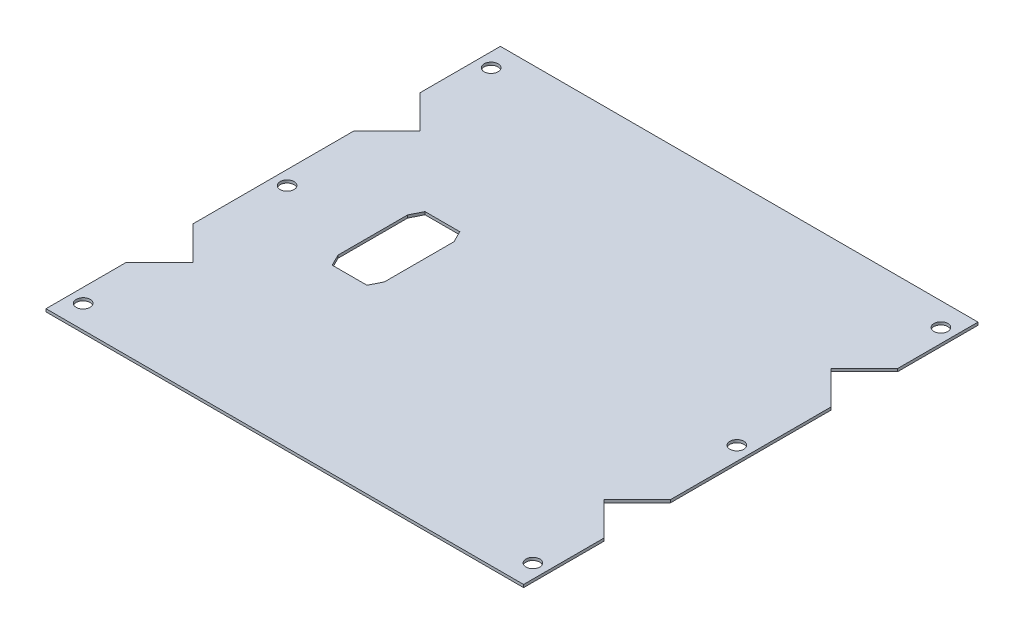
ISO-10303-21;
HEADER;
FILE_DESCRIPTION(('STEP AP214'),'2;1');
FILE_NAME('part.step','',(''),(''),'','','');
FILE_SCHEMA(('AUTOMOTIVE_DESIGN { 1 0 10303 214 1 1 1 1 }'));
ENDSEC;
DATA;
#1=APPLICATION_CONTEXT('core data for automotive mechanical design processes');
#2=APPLICATION_PROTOCOL_DEFINITION('international standard','automotive_design',2000,#1);
#3=PRODUCT_CONTEXT('',#1,'mechanical');
#4=PRODUCT('Part','Part','',(#3));
#5=PRODUCT_RELATED_PRODUCT_CATEGORY('part','',(#4));
#6=PRODUCT_DEFINITION_FORMATION('','',#4);
#7=PRODUCT_DEFINITION_CONTEXT('part definition',#1,'design');
#8=PRODUCT_DEFINITION('design','',#6,#7);
#9=PRODUCT_DEFINITION_SHAPE('','',#8);
#10=(LENGTH_UNIT() NAMED_UNIT(*) SI_UNIT(.MILLI.,.METRE.));
#11=(NAMED_UNIT(*) PLANE_ANGLE_UNIT() SI_UNIT($,.RADIAN.));
#12=(NAMED_UNIT(*) SI_UNIT($,.STERADIAN.) SOLID_ANGLE_UNIT());
#13=UNCERTAINTY_MEASURE_WITH_UNIT(LENGTH_MEASURE(1.E-05),#10,'distance_accuracy_value','');
#14=(GEOMETRIC_REPRESENTATION_CONTEXT(3) GLOBAL_UNCERTAINTY_ASSIGNED_CONTEXT((#13)) GLOBAL_UNIT_ASSIGNED_CONTEXT((#10,
#11,#12)) REPRESENTATION_CONTEXT('',''));
#15=CARTESIAN_POINT('',(0.,0.,0.));
#16=DIRECTION('',(0.,0.,1.));
#17=DIRECTION('',(1.,0.,0.));
#18=AXIS2_PLACEMENT_3D('',#15,#16,#17);
#19=CARTESIAN_POINT('',(0.,-1.2,0.));
#20=DIRECTION('',(0.,1.,0.));
#21=DIRECTION('',(0.,0.,1.));
#22=AXIS2_PLACEMENT_3D('',#19,#20,#21);
#23=PLANE('',#22);
#24=DIRECTION('',(-0.707106781186545,0.,0.70710678118655));
#25=VECTOR('',#24,1.);
#26=CARTESIAN_POINT('',(-90.1247785636564,-1.19999999999998,-47.4464466094067));
#27=LINE('',#26,#25);
#28=CARTESIAN_POINT('',(-88.6088358912349,-1.19999999999999,-48.9623892818282));
#29=VERTEX_POINT('',#28);
#30=CARTESIAN_POINT('',(-102.924778563656,-1.20000000000006,-34.6464466094066));
#31=VERTEX_POINT('',#30);
#32=EDGE_CURVE('E665',#29,#31,#27,.T.);
#33=ORIENTED_EDGE('',*,*,#32,.F.);
#34=DIRECTION('',(0.707106781186545,0.,0.70710678118655));
#35=VECTOR('',#34,1.);
#36=CARTESIAN_POINT('',(-124.884275797213,-1.20000000000032,-85.2378291878067));
#37=LINE('',#36,#35);
#38=CARTESIAN_POINT('',(-102.924778563656,-1.20000000000012,-63.2783319542499));
#39=VERTEX_POINT('',#38);
#40=EDGE_CURVE('E680',#39,#29,#37,.T.);
#41=ORIENTED_EDGE('',*,*,#40,.F.);
#42=DIRECTION('',(0.,0.,1.));
#43=VECTOR('',#42,1.);
#44=CARTESIAN_POINT('',(-102.924778563656,-1.20000000000007,-49.1247785636565));
#45=LINE('',#44,#43);
#46=CARTESIAN_POINT('',(-102.924778563656,-1.20000000000024,-97.9247785636565));
#47=VERTEX_POINT('',#46);
#48=EDGE_CURVE('E709',#39,#47,#45,.F.);
#49=ORIENTED_EDGE('',*,*,#48,.T.);
#50=DIRECTION('',(-1.,0.,0.));
#51=VECTOR('',#50,1.);
#52=CARTESIAN_POINT('',(-137.924778563656,-1.20000000000048,-97.9247785636565));
#53=LINE('',#52,#51);
#54=CARTESIAN_POINT('',(102.924778563657,-1.20000000000024,-97.9247785636565));
#55=VERTEX_POINT('',#54);
#56=EDGE_CURVE('E707',#47,#55,#53,.F.);
#57=ORIENTED_EDGE('',*,*,#56,.T.);
#58=DIRECTION('',(0.,0.,-1.));
#59=VECTOR('',#58,1.);
#60=CARTESIAN_POINT('',(102.924778563657,-1.20000000000007,-49.1247785636565));
#61=LINE('',#60,#59);
#62=CARTESIAN_POINT('',(102.924778563657,-1.20000000000012,-63.2783319542498));
#63=VERTEX_POINT('',#62);
#64=EDGE_CURVE('E701',#55,#63,#61,.F.);
#65=ORIENTED_EDGE('',*,*,#64,.T.);
#66=DIRECTION('',(0.707106781186545,0.,-0.70710678118655));
#67=VECTOR('',#66,1.);
#68=CARTESIAN_POINT('',(90.1247785636565,-1.20000000000001,-50.4783319542497));
#69=LINE('',#68,#67);
#70=CARTESIAN_POINT('',(88.608835891235,-1.19999999999998,-48.9623892818282));
#71=VERTEX_POINT('',#70);
#72=EDGE_CURVE('E676',#71,#63,#69,.T.);
#73=ORIENTED_EDGE('',*,*,#72,.F.);
#74=DIRECTION('',(-0.707106781186545,0.,-0.70710678118655));
#75=VECTOR('',#74,1.);
#76=CARTESIAN_POINT('',(157.837189477155,-1.20000000000046,20.2659643040927));
#77=LINE('',#76,#75);
#78=CARTESIAN_POINT('',(102.924778563656,-1.20000000000009,-34.6464466094066));
#79=VERTEX_POINT('',#78);
#80=EDGE_CURVE('E813',#79,#71,#77,.T.);
#81=ORIENTED_EDGE('',*,*,#80,.F.);
#82=DIRECTION('',(0.,0.,-1.));
#83=VECTOR('',#82,1.);
#84=CARTESIAN_POINT('',(102.924778563656,-1.20000000000009,0.));
#85=LINE('',#84,#83);
#86=CARTESIAN_POINT('',(102.924778563656,-1.20000000000009,34.6464466094067));
#87=VERTEX_POINT('',#86);
#88=EDGE_CURVE('E822',#79,#87,#85,.F.);
#89=ORIENTED_EDGE('',*,*,#88,.T.);
#90=DIRECTION('',(0.707106781186546,0.,-0.707106781186549));
#91=VECTOR('',#90,1.);
#92=CARTESIAN_POINT('',(90.1247785636565,-1.20000000000001,47.4464466094067));
#93=LINE('',#92,#91);
#94=CARTESIAN_POINT('',(88.608835891235,-1.19999999999998,48.9623892818283));
#95=VERTEX_POINT('',#94);
#96=EDGE_CURVE('E801',#95,#87,#93,.T.);
#97=ORIENTED_EDGE('',*,*,#96,.F.);
#98=DIRECTION('',(-0.707106781186546,0.,-0.707106781186549));
#99=VECTOR('',#98,1.);
#100=CARTESIAN_POINT('',(124.884275797213,-1.20000000000044,85.2378291878067));
#101=LINE('',#100,#99);
#102=CARTESIAN_POINT('',(102.924778563657,-1.20000000000017,63.2783319542498));
#103=VERTEX_POINT('',#102);
#104=EDGE_CURVE('E731',#103,#95,#101,.T.);
#105=ORIENTED_EDGE('',*,*,#104,.F.);
#106=DIRECTION('',(0.,0.,-1.));
#107=VECTOR('',#106,1.);
#108=CARTESIAN_POINT('',(102.924778563657,-1.20000000000006,49.1247785636563));
#109=LINE('',#108,#107);
#110=CARTESIAN_POINT('',(102.924778563656,-1.2000000000004,97.9247785636565));
#111=VERTEX_POINT('',#110);
#112=EDGE_CURVE('E747',#103,#111,#109,.F.);
#113=ORIENTED_EDGE('',*,*,#112,.T.);
#114=DIRECTION('',(1.,0.,0.));
#115=VECTOR('',#114,1.);
#116=CARTESIAN_POINT('',(-137.924778563656,-1.20000000000064,97.9247785636565));
#117=LINE('',#116,#115);
#118=CARTESIAN_POINT('',(-102.924778563656,-1.20000000000041,97.9247785636565));
#119=VERTEX_POINT('',#118);
#120=EDGE_CURVE('E753',#111,#119,#117,.F.);
#121=ORIENTED_EDGE('',*,*,#120,.T.);
#122=DIRECTION('',(0.,0.,1.));
#123=VECTOR('',#122,1.);
#124=CARTESIAN_POINT('',(-102.924778563656,-1.20000000000006,49.1247785636563));
#125=LINE('',#124,#123);
#126=CARTESIAN_POINT('',(-102.924778563656,-1.20000000000016,63.2783319542498));
#127=VERTEX_POINT('',#126);
#128=EDGE_CURVE('E755',#119,#127,#125,.F.);
#129=ORIENTED_EDGE('',*,*,#128,.T.);
#130=DIRECTION('',(-0.707106781186546,0.,0.707106781186549));
#131=VECTOR('',#130,1.);
#132=CARTESIAN_POINT('',(-90.1247785636564,-1.19999999999999,50.4783319542497));
#133=LINE('',#132,#131);
#134=CARTESIAN_POINT('',(-88.6088358912349,-1.19999999999997,48.9623892818282));
#135=VERTEX_POINT('',#134);
#136=EDGE_CURVE('E741',#135,#127,#133,.T.);
#137=ORIENTED_EDGE('',*,*,#136,.F.);
#138=DIRECTION('',(0.707106781186546,0.,0.707106781186549));
#139=VECTOR('',#138,1.);
#140=CARTESIAN_POINT('',(-157.837189477155,-1.20000000000045,-20.2659643040926));
#141=LINE('',#140,#139);
#142=CARTESIAN_POINT('',(-102.924778563656,-1.20000000000009,34.6464466094067));
#143=VERTEX_POINT('',#142);
#144=EDGE_CURVE('E786',#143,#135,#141,.T.);
#145=ORIENTED_EDGE('',*,*,#144,.F.);
#146=DIRECTION('',(0.,0.,1.));
#147=VECTOR('',#146,1.);
#148=CARTESIAN_POINT('',(-102.924778563656,-1.20000000000008,0.));
#149=LINE('',#148,#147);
#150=EDGE_CURVE('E795',#143,#31,#149,.F.);
#151=ORIENTED_EDGE('',*,*,#150,.T.);
#152=EDGE_LOOP('',(#33,#41,#49,#57,#65,#73,#81,#89,#97,#105,#113,#121,#129,#137,#145,#151));
#153=FACE_BOUND('',#152,.T.);
#154=DIRECTION('',(1.,0.,0.));
#155=VECTOR('',#154,1.);
#156=CARTESIAN_POINT('',(-57.5,-1.2,20.));
#157=LINE('',#156,#155);
#158=CARTESIAN_POINT('',(-57.5,-1.2,20.));
#159=VERTEX_POINT('',#158);
#160=CARTESIAN_POINT('',(-42.5,-1.2,20.));
#161=VERTEX_POINT('',#160);
#162=EDGE_CURVE('E848',#159,#161,#157,.T.);
#163=ORIENTED_EDGE('',*,*,#162,.T.);
#164=DIRECTION('',(0.447213595499954,0.,-0.894427190999918));
#165=VECTOR('',#164,1.);
#166=CARTESIAN_POINT('',(-42.5,-1.2,20.));
#167=LINE('',#166,#165);
#168=CARTESIAN_POINT('',(-40.,-1.2,15.));
#169=VERTEX_POINT('',#168);
#170=EDGE_CURVE('E828',#161,#169,#167,.T.);
#171=ORIENTED_EDGE('',*,*,#170,.T.);
#172=DIRECTION('',(0.,0.,-1.));
#173=VECTOR('',#172,1.);
#174=CARTESIAN_POINT('',(-40.,-1.2,15.));
#175=LINE('',#174,#173);
#176=CARTESIAN_POINT('',(-40.,-1.2,-15.));
#177=VERTEX_POINT('',#176);
#178=EDGE_CURVE('E831',#169,#177,#175,.T.);
#179=ORIENTED_EDGE('',*,*,#178,.T.);
#180=DIRECTION('',(-0.447213595499954,0.,-0.894427190999918));
#181=VECTOR('',#180,1.);
#182=CARTESIAN_POINT('',(-42.5,-1.2,-20.));
#183=LINE('',#182,#181);
#184=CARTESIAN_POINT('',(-42.5,-1.2,-20.));
#185=VERTEX_POINT('',#184);
#186=EDGE_CURVE('E509',#177,#185,#183,.T.);
#187=ORIENTED_EDGE('',*,*,#186,.T.);
#188=DIRECTION('',(-1.,0.,0.));
#189=VECTOR('',#188,1.);
#190=CARTESIAN_POINT('',(-57.5,-1.2,-20.));
#191=LINE('',#190,#189);
#192=CARTESIAN_POINT('',(-57.5,-1.2,-20.));
#193=VERTEX_POINT('',#192);
#194=EDGE_CURVE('E836',#185,#193,#191,.T.);
#195=ORIENTED_EDGE('',*,*,#194,.T.);
#196=DIRECTION('',(-0.447213595499958,0.,0.894427190999916));
#197=VECTOR('',#196,1.);
#198=CARTESIAN_POINT('',(-60.,-1.2,-15.));
#199=LINE('',#198,#197);
#200=CARTESIAN_POINT('',(-60.,-1.2,-15.));
#201=VERTEX_POINT('',#200);
#202=EDGE_CURVE('E839',#193,#201,#199,.T.);
#203=ORIENTED_EDGE('',*,*,#202,.T.);
#204=DIRECTION('',(0.,0.,1.));
#205=VECTOR('',#204,1.);
#206=CARTESIAN_POINT('',(-60.,-1.2,15.));
#207=LINE('',#206,#205);
#208=CARTESIAN_POINT('',(-60.,-1.2,15.));
#209=VERTEX_POINT('',#208);
#210=EDGE_CURVE('E842',#201,#209,#207,.T.);
#211=ORIENTED_EDGE('',*,*,#210,.T.);
#212=DIRECTION('',(0.447213595499958,0.,0.894427190999916));
#213=VECTOR('',#212,1.);
#214=CARTESIAN_POINT('',(-57.5,-1.2,20.));
#215=LINE('',#214,#213);
#216=EDGE_CURVE('E845',#209,#159,#215,.T.);
#217=ORIENTED_EDGE('',*,*,#216,.T.);
#218=EDGE_LOOP('',(#163,#171,#179,#187,#195,#203,#211,#217));
#219=FACE_BOUND('',#218,.T.);
#220=CARTESIAN_POINT('',(96.9247785636565,-1.20000000000006,5.49077691526572E-13));
#221=DIRECTION('',(0.,-1.,0.));
#222=DIRECTION('',(1.,0.,0.));
#223=AXIS2_PLACEMENT_3D('',#220,#221,#222);
#224=CIRCLE('',#223,3.);
#225=CARTESIAN_POINT('',(99.9247785636565,-1.20000000000008,5.49077691526572E-13));
#226=VERTEX_POINT('',#225);
#227=EDGE_CURVE('E824',#226,#226,#224,.F.);
#228=ORIENTED_EDGE('',*,*,#227,.T.);
#229=EDGE_LOOP('',(#228));
#230=FACE_BOUND('',#229,.T.);
#231=CARTESIAN_POINT('',(-96.9247785636564,-1.20000000000019,0.));
#232=DIRECTION('',(0.,-1.,0.));
#233=DIRECTION('',(0.,0.,1.));
#234=AXIS2_PLACEMENT_3D('',#231,#232,#233);
#235=CIRCLE('',#234,3.);
#236=CARTESIAN_POINT('',(-96.9247785636564,-1.2000000000002,3.00000000000001));
#237=VERTEX_POINT('',#236);
#238=EDGE_CURVE('E797',#237,#237,#235,.T.);
#239=ORIENTED_EDGE('',*,*,#238,.F.);
#240=EDGE_LOOP('',(#239));
#241=FACE_BOUND('',#240,.T.);
#242=CARTESIAN_POINT('',(96.9247785636559,-1.2000000000004,87.9247785636565));
#243=DIRECTION('',(0.,-1.,0.));
#244=DIRECTION('',(0.,0.,1.));
#245=AXIS2_PLACEMENT_3D('',#242,#243,#244);
#246=CIRCLE('',#245,3.);
#247=CARTESIAN_POINT('',(96.9247785636559,-1.20000000000043,90.9247785636565));
#248=VERTEX_POINT('',#247);
#249=EDGE_CURVE('E750',#248,#248,#246,.F.);
#250=ORIENTED_EDGE('',*,*,#249,.T.);
#251=EDGE_LOOP('',(#250));
#252=FACE_BOUND('',#251,.T.);
#253=CARTESIAN_POINT('',(-96.9247785636564,-1.20000000000057,87.9247785636564));
#254=DIRECTION('',(0.,-1.,0.));
#255=DIRECTION('',(1.,0.,0.));
#256=AXIS2_PLACEMENT_3D('',#253,#254,#255);
#257=CIRCLE('',#256,3.);
#258=CARTESIAN_POINT('',(-93.9247785636564,-1.20000000000057,87.9247785636565));
#259=VERTEX_POINT('',#258);
#260=EDGE_CURVE('E694',#259,#259,#257,.T.);
#261=ORIENTED_EDGE('',*,*,#260,.F.);
#262=EDGE_LOOP('',(#261));
#263=FACE_BOUND('',#262,.T.);
#264=CARTESIAN_POINT('',(96.9247785636563,-1.20000000000026,-87.9247785636565));
#265=DIRECTION('',(0.,-1.,0.));
#266=DIRECTION('',(0.,0.,-1.));
#267=AXIS2_PLACEMENT_3D('',#264,#265,#266);
#268=CIRCLE('',#267,3.);
#269=CARTESIAN_POINT('',(96.9247785636563,-1.20000000000028,-90.9247785636565));
#270=VERTEX_POINT('',#269);
#271=EDGE_CURVE('E704',#270,#270,#268,.F.);
#272=ORIENTED_EDGE('',*,*,#271,.T.);
#273=EDGE_LOOP('',(#272));
#274=FACE_BOUND('',#273,.T.);
#275=CARTESIAN_POINT('',(-96.9247785636557,-1.20000000000018,-87.9247785636565));
#276=DIRECTION('',(0.,-1.,0.));
#277=DIRECTION('',(1.,0.,0.));
#278=AXIS2_PLACEMENT_3D('',#275,#276,#277);
#279=CIRCLE('',#278,3.);
#280=CARTESIAN_POINT('',(-93.9247785636557,-1.20000000000016,-87.9247785636565));
#281=VERTEX_POINT('',#280);
#282=EDGE_CURVE('E692',#281,#281,#279,.T.);
#283=ORIENTED_EDGE('',*,*,#282,.F.);
#284=EDGE_LOOP('',(#283));
#285=FACE_BOUND('',#284,.T.);
#286=ADVANCED_FACE('F492',(#153,#219,#230,#241,#252,#263,#274,#285),#23,.F.);
#287=CARTESIAN_POINT('',(0.,0.,0.));
#288=DIRECTION('',(0.,1.,0.));
#289=DIRECTION('',(0.,0.,1.));
#290=AXIS2_PLACEMENT_3D('',#287,#288,#289);
#291=PLANE('',#290);
#292=DIRECTION('',(-0.707106781186545,0.,-0.70710678118655));
#293=VECTOR('',#292,1.);
#294=CARTESIAN_POINT('',(-113.348001868359,-2.28983498828939E-13,-73.701555258953));
#295=LINE('',#294,#293);
#296=CARTESIAN_POINT('',(-88.6088358912349,0.,-48.9623892818282));
#297=VERTEX_POINT('',#296);
#298=CARTESIAN_POINT('',(-102.924778563656,-1.11022302462516E-13,-63.2783319542499));
#299=VERTEX_POINT('',#298);
#300=EDGE_CURVE('E669',#297,#299,#295,.T.);
#301=ORIENTED_EDGE('',*,*,#300,.F.);
#302=DIRECTION('',(0.707106781186545,0.,-0.70710678118655));
#303=VECTOR('',#302,1.);
#304=CARTESIAN_POINT('',(-113.34800186836,-1.52655665885959E-13,-24.2232233047033));
#305=LINE('',#304,#303);
#306=CARTESIAN_POINT('',(-102.924778563656,0.,-34.6464466094066));
#307=VERTEX_POINT('',#306);
#308=EDGE_CURVE('E655',#307,#297,#305,.T.);
#309=ORIENTED_EDGE('',*,*,#308,.F.);
#310=DIRECTION('',(0.,0.,-1.));
#311=VECTOR('',#310,1.);
#312=CARTESIAN_POINT('',(-102.924778563656,0.,47.8));
#313=LINE('',#312,#311);
#314=CARTESIAN_POINT('',(-102.924778563656,0.,34.6464466094067));
#315=VERTEX_POINT('',#314);
#316=EDGE_CURVE('E734',#315,#307,#313,.T.);
#317=ORIENTED_EDGE('',*,*,#316,.F.);
#318=DIRECTION('',(-0.707106781186546,0.,-0.707106781186549));
#319=VECTOR('',#318,1.);
#320=CARTESIAN_POINT('',(-113.34800186836,-1.38777878078145E-13,24.2232233047034));
#321=LINE('',#320,#319);
#322=CARTESIAN_POINT('',(-88.6088358912349,0.,48.9623892818282));
#323=VERTEX_POINT('',#322);
#324=EDGE_CURVE('E792',#323,#315,#321,.T.);
#325=ORIENTED_EDGE('',*,*,#324,.F.);
#326=DIRECTION('',(0.707106781186546,0.,-0.707106781186549));
#327=VECTOR('',#326,1.);
#328=CARTESIAN_POINT('',(-113.348001868359,-2.98372437868011E-13,73.7015552589529));
#329=LINE('',#328,#327);
#330=CARTESIAN_POINT('',(-102.924778563656,-1.52655665885959E-13,63.2783319542498));
#331=VERTEX_POINT('',#330);
#332=EDGE_CURVE('E743',#331,#323,#329,.T.);
#333=ORIENTED_EDGE('',*,*,#332,.F.);
#334=DIRECTION('',(0.,0.,-1.));
#335=VECTOR('',#334,1.);
#336=CARTESIAN_POINT('',(-102.924778563656,-4.02455846426619E-13,97.9247785636565));
#337=LINE('',#336,#335);
#338=CARTESIAN_POINT('',(-102.924778563656,-4.02455846426619E-13,97.9247785636565));
#339=VERTEX_POINT('',#338);
#340=EDGE_CURVE('E767',#339,#331,#337,.T.);
#341=ORIENTED_EDGE('',*,*,#340,.F.);
#342=DIRECTION('',(-1.,0.,0.));
#343=VECTOR('',#342,1.);
#344=CARTESIAN_POINT('',(-89.1247785636564,-3.19189119579733E-13,97.9247785636565));
#345=LINE('',#344,#343);
#346=CARTESIAN_POINT('',(102.924778563657,-3.95516952522712E-13,97.9247785636565));
#347=VERTEX_POINT('',#346);
#348=EDGE_CURVE('E776',#347,#339,#345,.T.);
#349=ORIENTED_EDGE('',*,*,#348,.F.);
#350=DIRECTION('',(0.,0.,1.));
#351=VECTOR('',#350,1.);
#352=CARTESIAN_POINT('',(102.924778563657,0.,50.1247785636565));
#353=LINE('',#352,#351);
#354=CARTESIAN_POINT('',(102.924778563657,-1.59594559789866E-13,63.2783319542498));
#355=VERTEX_POINT('',#354);
#356=EDGE_CURVE('E761',#355,#347,#353,.T.);
#357=ORIENTED_EDGE('',*,*,#356,.F.);
#358=DIRECTION('',(0.707106781186546,0.,0.707106781186549));
#359=VECTOR('',#358,1.);
#360=CARTESIAN_POINT('',(113.34800186836,-3.05311331771918E-13,73.7015552589529));
#361=LINE('',#360,#359);
#362=CARTESIAN_POINT('',(88.608835891235,0.,48.9623892818283));
#363=VERTEX_POINT('',#362);
#364=EDGE_CURVE('E738',#363,#355,#361,.T.);
#365=ORIENTED_EDGE('',*,*,#364,.F.);
#366=DIRECTION('',(-0.707106781186546,0.,0.707106781186549));
#367=VECTOR('',#366,1.);
#368=CARTESIAN_POINT('',(113.34800186836,-1.52655665885959E-13,24.2232233047034));
#369=LINE('',#368,#367);
#370=CARTESIAN_POINT('',(102.924778563656,0.,34.6464466094067));
#371=VERTEX_POINT('',#370);
#372=EDGE_CURVE('E804',#371,#363,#369,.T.);
#373=ORIENTED_EDGE('',*,*,#372,.F.);
#374=DIRECTION('',(0.,0.,1.));
#375=VECTOR('',#374,1.);
#376=CARTESIAN_POINT('',(102.924778563656,0.,-47.8));
#377=LINE('',#376,#375);
#378=CARTESIAN_POINT('',(102.924778563656,0.,-34.6464466094066));
#379=VERTEX_POINT('',#378);
#380=EDGE_CURVE('E780',#379,#371,#377,.T.);
#381=ORIENTED_EDGE('',*,*,#380,.F.);
#382=DIRECTION('',(0.707106781186545,0.,0.70710678118655));
#383=VECTOR('',#382,1.);
#384=CARTESIAN_POINT('',(113.34800186836,-1.52655665885959E-13,-24.2232233047033));
#385=LINE('',#384,#383);
#386=CARTESIAN_POINT('',(88.608835891235,0.,-48.9623892818282));
#387=VERTEX_POINT('',#386);
#388=EDGE_CURVE('E819',#387,#379,#385,.T.);
#389=ORIENTED_EDGE('',*,*,#388,.F.);
#390=DIRECTION('',(-0.707106781186545,0.,0.70710678118655));
#391=VECTOR('',#390,1.);
#392=CARTESIAN_POINT('',(113.34800186836,-2.28983498828939E-13,-73.701555258953));
#393=LINE('',#392,#391);
#394=CARTESIAN_POINT('',(102.924778563657,-1.11022302462516E-13,-63.2783319542499));
#395=VERTEX_POINT('',#394);
#396=EDGE_CURVE('E697',#395,#387,#393,.T.);
#397=ORIENTED_EDGE('',*,*,#396,.F.);
#398=DIRECTION('',(0.,0.,1.));
#399=VECTOR('',#398,1.);
#400=CARTESIAN_POINT('',(102.924778563657,-2.35922392732846E-13,-97.9247785636565));
#401=LINE('',#400,#399);
#402=CARTESIAN_POINT('',(102.924778563657,-2.35922392732846E-13,-97.9247785636565));
#403=VERTEX_POINT('',#402);
#404=EDGE_CURVE('E718',#403,#395,#401,.T.);
#405=ORIENTED_EDGE('',*,*,#404,.F.);
#406=DIRECTION('',(1.,0.,0.));
#407=VECTOR('',#406,1.);
#408=CARTESIAN_POINT('',(-102.924778563656,-2.35922392732846E-13,-97.9247785636565));
#409=LINE('',#408,#407);
#410=CARTESIAN_POINT('',(-102.924778563656,-2.35922392732846E-13,-97.9247785636565));
#411=VERTEX_POINT('',#410);
#412=EDGE_CURVE('E724',#411,#403,#409,.T.);
#413=ORIENTED_EDGE('',*,*,#412,.F.);
#414=DIRECTION('',(0.,0.,-1.));
#415=VECTOR('',#414,1.);
#416=CARTESIAN_POINT('',(-102.924778563656,0.,-50.1247785636565));
#417=LINE('',#416,#415);
#418=EDGE_CURVE('E672',#299,#411,#417,.T.);
#419=ORIENTED_EDGE('',*,*,#418,.F.);
#420=EDGE_LOOP('',(#301,#309,#317,#325,#333,#341,#349,#357,#365,#373,#381,#389,#397,#405,#413,#419));
#421=FACE_BOUND('',#420,.T.);
#422=DIRECTION('',(0.447213595499954,0.,-0.894427190999918));
#423=VECTOR('',#422,1.);
#424=CARTESIAN_POINT('',(-42.5,0.,20.));
#425=LINE('',#424,#423);
#426=CARTESIAN_POINT('',(-42.5,0.,20.));
#427=VERTEX_POINT('',#426);
#428=CARTESIAN_POINT('',(-40.,0.,15.));
#429=VERTEX_POINT('',#428);
#430=EDGE_CURVE('E516',#427,#429,#425,.T.);
#431=ORIENTED_EDGE('',*,*,#430,.F.);
#432=DIRECTION('',(1.,0.,0.));
#433=VECTOR('',#432,1.);
#434=CARTESIAN_POINT('',(-57.5,0.,20.));
#435=LINE('',#434,#433);
#436=CARTESIAN_POINT('',(-57.5,0.,20.));
#437=VERTEX_POINT('',#436);
#438=EDGE_CURVE('E832',#437,#427,#435,.T.);
#439=ORIENTED_EDGE('',*,*,#438,.F.);
#440=DIRECTION('',(0.447213595499958,0.,0.894427190999916));
#441=VECTOR('',#440,1.);
#442=CARTESIAN_POINT('',(-57.5,0.,20.));
#443=LINE('',#442,#441);
#444=CARTESIAN_POINT('',(-60.,0.,15.));
#445=VERTEX_POINT('',#444);
#446=EDGE_CURVE('E867',#445,#437,#443,.T.);
#447=ORIENTED_EDGE('',*,*,#446,.F.);
#448=DIRECTION('',(0.,0.,1.));
#449=VECTOR('',#448,1.);
#450=CARTESIAN_POINT('',(-60.,0.,15.));
#451=LINE('',#450,#449);
#452=CARTESIAN_POINT('',(-60.,0.,-15.));
#453=VERTEX_POINT('',#452);
#454=EDGE_CURVE('E864',#453,#445,#451,.T.);
#455=ORIENTED_EDGE('',*,*,#454,.F.);
#456=DIRECTION('',(-0.447213595499958,0.,0.894427190999916));
#457=VECTOR('',#456,1.);
#458=CARTESIAN_POINT('',(-60.,0.,-15.));
#459=LINE('',#458,#457);
#460=CARTESIAN_POINT('',(-57.5,0.,-20.));
#461=VERTEX_POINT('',#460);
#462=EDGE_CURVE('E861',#461,#453,#459,.T.);
#463=ORIENTED_EDGE('',*,*,#462,.F.);
#464=DIRECTION('',(-1.,0.,0.));
#465=VECTOR('',#464,1.);
#466=CARTESIAN_POINT('',(-57.5,0.,-20.));
#467=LINE('',#466,#465);
#468=CARTESIAN_POINT('',(-42.5,0.,-20.));
#469=VERTEX_POINT('',#468);
#470=EDGE_CURVE('E858',#469,#461,#467,.T.);
#471=ORIENTED_EDGE('',*,*,#470,.F.);
#472=DIRECTION('',(-0.447213595499954,0.,-0.894427190999918));
#473=VECTOR('',#472,1.);
#474=CARTESIAN_POINT('',(-42.5,0.,-20.));
#475=LINE('',#474,#473);
#476=CARTESIAN_POINT('',(-40.,0.,-15.));
#477=VERTEX_POINT('',#476);
#478=EDGE_CURVE('E855',#477,#469,#475,.T.);
#479=ORIENTED_EDGE('',*,*,#478,.F.);
#480=DIRECTION('',(0.,0.,-1.));
#481=VECTOR('',#480,1.);
#482=CARTESIAN_POINT('',(-40.,0.,15.));
#483=LINE('',#482,#481);
#484=EDGE_CURVE('E852',#429,#477,#483,.T.);
#485=ORIENTED_EDGE('',*,*,#484,.F.);
#486=EDGE_LOOP('',(#431,#439,#447,#455,#463,#471,#479,#485));
#487=FACE_BOUND('',#486,.T.);
#488=CARTESIAN_POINT('',(96.9247785636565,0.,5.45457399054968E-13));
#489=DIRECTION('',(0.,-1.,0.));
#490=DIRECTION('',(1.,0.,0.));
#491=AXIS2_PLACEMENT_3D('',#488,#489,#490);
#492=CIRCLE('',#491,3.);
#493=CARTESIAN_POINT('',(99.9247785636565,0.,5.45457399054968E-13));
#494=VERTEX_POINT('',#493);
#495=EDGE_CURVE('E810',#494,#494,#492,.T.);
#496=ORIENTED_EDGE('',*,*,#495,.T.);
#497=EDGE_LOOP('',(#496));
#498=FACE_BOUND('',#497,.T.);
#499=CARTESIAN_POINT('',(-96.9247785636564,0.,0.));
#500=DIRECTION('',(0.,-1.,0.));
#501=DIRECTION('',(1.,0.,0.));
#502=AXIS2_PLACEMENT_3D('',#499,#500,#501);
#503=CIRCLE('',#502,3.);
#504=CARTESIAN_POINT('',(-93.9247785636564,0.,0.));
#505=VERTEX_POINT('',#504);
#506=EDGE_CURVE('E783',#505,#505,#503,.T.);
#507=ORIENTED_EDGE('',*,*,#506,.T.);
#508=EDGE_LOOP('',(#507));
#509=FACE_BOUND('',#508,.T.);
#510=CARTESIAN_POINT('',(96.9247785636559,-3.05311331771918E-13,87.9247785636565));
#511=DIRECTION('',(0.,-1.,0.));
#512=DIRECTION('',(1.,0.,0.));
#513=AXIS2_PLACEMENT_3D('',#510,#511,#512);
#514=CIRCLE('',#513,3.);
#515=CARTESIAN_POINT('',(99.9247785636559,-3.24836506967457E-13,87.9247785636564));
#516=VERTEX_POINT('',#515);
#517=EDGE_CURVE('E758',#516,#516,#514,.T.);
#518=ORIENTED_EDGE('',*,*,#517,.T.);
#519=EDGE_LOOP('',(#518));
#520=FACE_BOUND('',#519,.T.);
#521=CARTESIAN_POINT('',(-96.9247785636564,-3.12250225675825E-13,87.9247785636565));
#522=DIRECTION('',(0.,-1.,0.));
#523=DIRECTION('',(1.,0.,0.));
#524=AXIS2_PLACEMENT_3D('',#521,#522,#523);
#525=CIRCLE('',#524,3.);
#526=CARTESIAN_POINT('',(-93.9247785636564,-2.92725050480287E-13,87.9247785636565));
#527=VERTEX_POINT('',#526);
#528=EDGE_CURVE('E764',#527,#527,#525,.T.);
#529=ORIENTED_EDGE('',*,*,#528,.T.);
#530=EDGE_LOOP('',(#529));
#531=FACE_BOUND('',#530,.T.);
#532=CARTESIAN_POINT('',(-96.9247785636557,-2.0122792321331E-13,-87.9247785636565));
#533=DIRECTION('',(0.,-1.,0.));
#534=DIRECTION('',(-1.,0.,0.));
#535=AXIS2_PLACEMENT_3D('',#532,#533,#534);
#536=CIRCLE('',#535,3.);
#537=CARTESIAN_POINT('',(-99.9247785636557,-2.20753098408848E-13,-87.9247785636565));
#538=VERTEX_POINT('',#537);
#539=EDGE_CURVE('E711',#538,#538,#536,.T.);
#540=ORIENTED_EDGE('',*,*,#539,.T.);
#541=EDGE_LOOP('',(#540));
#542=FACE_BOUND('',#541,.T.);
#543=CARTESIAN_POINT('',(96.9247785636563,-1.73472347597681E-13,-87.9247785636565));
#544=DIRECTION('',(0.,-1.,0.));
#545=DIRECTION('',(-1.,0.,0.));
#546=AXIS2_PLACEMENT_3D('',#543,#544,#545);
#547=CIRCLE('',#546,3.);
#548=CARTESIAN_POINT('',(93.9247785636563,-1.53947172402142E-13,-87.9247785636565));
#549=VERTEX_POINT('',#548);
#550=EDGE_CURVE('E715',#549,#549,#547,.T.);
#551=ORIENTED_EDGE('',*,*,#550,.T.);
#552=EDGE_LOOP('',(#551));
#553=FACE_BOUND('',#552,.T.);
#554=ADVANCED_FACE('F494',(#421,#487,#498,#509,#520,#531,#542,#553),#291,.T.);
#555=CARTESIAN_POINT('',(-42.5,-1.2,20.));
#556=DIRECTION('',(0.894427190999918,0.,0.447213595499954));
#557=DIRECTION('',(0.447213595499954,0.,-0.894427190999918));
#558=AXIS2_PLACEMENT_3D('',#555,#556,#557);
#559=PLANE('',#558);
#560=ORIENTED_EDGE('',*,*,#430,.T.);
#561=DIRECTION('',(0.,1.,0.));
#562=VECTOR('',#561,1.);
#563=CARTESIAN_POINT('',(-40.,-1.2,15.));
#564=LINE('',#563,#562);
#565=EDGE_CURVE('E496',#169,#429,#564,.T.);
#566=ORIENTED_EDGE('',*,*,#565,.F.);
#567=ORIENTED_EDGE('',*,*,#170,.F.);
#568=DIRECTION('',(0.,1.,0.));
#569=VECTOR('',#568,1.);
#570=CARTESIAN_POINT('',(-42.5,-1.2,20.));
#571=LINE('',#570,#569);
#572=EDGE_CURVE('E13',#161,#427,#571,.T.);
#573=ORIENTED_EDGE('',*,*,#572,.T.);
#574=EDGE_LOOP('',(#560,#566,#567,#573));
#575=FACE_BOUND('',#574,.T.);
#576=ADVANCED_FACE('F899',(#575),#559,.F.);
#577=CARTESIAN_POINT('',(-57.5,-1.2,20.));
#578=DIRECTION('',(0.,0.,1.));
#579=DIRECTION('',(1.,0.,0.));
#580=AXIS2_PLACEMENT_3D('',#577,#578,#579);
#581=PLANE('',#580);
#582=ORIENTED_EDGE('',*,*,#438,.T.);
#583=ORIENTED_EDGE('',*,*,#572,.F.);
#584=ORIENTED_EDGE('',*,*,#162,.F.);
#585=DIRECTION('',(0.,1.,0.));
#586=VECTOR('',#585,1.);
#587=CARTESIAN_POINT('',(-57.5,-1.2,20.));
#588=LINE('',#587,#586);
#589=EDGE_CURVE('E501',#159,#437,#588,.T.);
#590=ORIENTED_EDGE('',*,*,#589,.T.);
#591=EDGE_LOOP('',(#582,#583,#584,#590));
#592=FACE_BOUND('',#591,.T.);
#593=ADVANCED_FACE('F901',(#592),#581,.F.);
#594=CARTESIAN_POINT('',(-57.5,-1.2,20.));
#595=DIRECTION('',(-0.894427190999916,0.,0.447213595499958));
#596=DIRECTION('',(0.447213595499958,0.,0.894427190999916));
#597=AXIS2_PLACEMENT_3D('',#594,#595,#596);
#598=PLANE('',#597);
#599=ORIENTED_EDGE('',*,*,#446,.T.);
#600=ORIENTED_EDGE('',*,*,#589,.F.);
#601=ORIENTED_EDGE('',*,*,#216,.F.);
#602=DIRECTION('',(0.,1.,0.));
#603=VECTOR('',#602,1.);
#604=CARTESIAN_POINT('',(-60.,-1.2,15.));
#605=LINE('',#604,#603);
#606=EDGE_CURVE('E873',#209,#445,#605,.T.);
#607=ORIENTED_EDGE('',*,*,#606,.T.);
#608=EDGE_LOOP('',(#599,#600,#601,#607));
#609=FACE_BOUND('',#608,.T.);
#610=ADVANCED_FACE('F905',(#609),#598,.F.);
#611=CARTESIAN_POINT('',(-60.,-1.2,15.));
#612=DIRECTION('',(-1.,0.,0.));
#613=DIRECTION('',(0.,0.,1.));
#614=AXIS2_PLACEMENT_3D('',#611,#612,#613);
#615=PLANE('',#614);
#616=ORIENTED_EDGE('',*,*,#454,.T.);
#617=ORIENTED_EDGE('',*,*,#606,.F.);
#618=ORIENTED_EDGE('',*,*,#210,.F.);
#619=DIRECTION('',(0.,1.,0.));
#620=VECTOR('',#619,1.);
#621=CARTESIAN_POINT('',(-60.,-1.2,-15.));
#622=LINE('',#621,#620);
#623=EDGE_CURVE('E875',#201,#453,#622,.T.);
#624=ORIENTED_EDGE('',*,*,#623,.T.);
#625=EDGE_LOOP('',(#616,#617,#618,#624));
#626=FACE_BOUND('',#625,.T.);
#627=ADVANCED_FACE('F909',(#626),#615,.F.);
#628=CARTESIAN_POINT('',(-60.,-1.2,-15.));
#629=DIRECTION('',(-0.894427190999916,0.,-0.447213595499958));
#630=DIRECTION('',(-0.447213595499958,0.,0.894427190999916));
#631=AXIS2_PLACEMENT_3D('',#628,#629,#630);
#632=PLANE('',#631);
#633=ORIENTED_EDGE('',*,*,#462,.T.);
#634=ORIENTED_EDGE('',*,*,#623,.F.);
#635=ORIENTED_EDGE('',*,*,#202,.F.);
#636=DIRECTION('',(0.,1.,0.));
#637=VECTOR('',#636,1.);
#638=CARTESIAN_POINT('',(-57.5,-1.2,-20.));
#639=LINE('',#638,#637);
#640=EDGE_CURVE('E877',#193,#461,#639,.T.);
#641=ORIENTED_EDGE('',*,*,#640,.T.);
#642=EDGE_LOOP('',(#633,#634,#635,#641));
#643=FACE_BOUND('',#642,.T.);
#644=ADVANCED_FACE('F911',(#643),#632,.F.);
#645=CARTESIAN_POINT('',(-57.5,-1.2,-20.));
#646=DIRECTION('',(0.,0.,-1.));
#647=DIRECTION('',(-1.,0.,0.));
#648=AXIS2_PLACEMENT_3D('',#645,#646,#647);
#649=PLANE('',#648);
#650=ORIENTED_EDGE('',*,*,#470,.T.);
#651=ORIENTED_EDGE('',*,*,#640,.F.);
#652=ORIENTED_EDGE('',*,*,#194,.F.);
#653=DIRECTION('',(0.,1.,0.));
#654=VECTOR('',#653,1.);
#655=CARTESIAN_POINT('',(-42.5,-1.2,-20.));
#656=LINE('',#655,#654);
#657=EDGE_CURVE('E879',#185,#469,#656,.T.);
#658=ORIENTED_EDGE('',*,*,#657,.T.);
#659=EDGE_LOOP('',(#650,#651,#652,#658));
#660=FACE_BOUND('',#659,.T.);
#661=ADVANCED_FACE('F894',(#660),#649,.F.);
#662=CARTESIAN_POINT('',(-42.5,-1.2,-20.));
#663=DIRECTION('',(0.894427190999918,0.,-0.447213595499954));
#664=DIRECTION('',(-0.447213595499954,0.,-0.894427190999918));
#665=AXIS2_PLACEMENT_3D('',#662,#663,#664);
#666=PLANE('',#665);
#667=ORIENTED_EDGE('',*,*,#478,.T.);
#668=ORIENTED_EDGE('',*,*,#657,.F.);
#669=ORIENTED_EDGE('',*,*,#186,.F.);
#670=DIRECTION('',(0.,1.,0.));
#671=VECTOR('',#670,1.);
#672=CARTESIAN_POINT('',(-40.,-1.2,-15.));
#673=LINE('',#672,#671);
#674=EDGE_CURVE('E880',#177,#477,#673,.T.);
#675=ORIENTED_EDGE('',*,*,#674,.T.);
#676=EDGE_LOOP('',(#667,#668,#669,#675));
#677=FACE_BOUND('',#676,.T.);
#678=ADVANCED_FACE('F891',(#677),#666,.F.);
#679=CARTESIAN_POINT('',(-40.,-1.2,15.));
#680=DIRECTION('',(1.,0.,0.));
#681=DIRECTION('',(0.,0.,-1.));
#682=AXIS2_PLACEMENT_3D('',#679,#680,#681);
#683=PLANE('',#682);
#684=ORIENTED_EDGE('',*,*,#484,.T.);
#685=ORIENTED_EDGE('',*,*,#674,.F.);
#686=ORIENTED_EDGE('',*,*,#178,.F.);
#687=ORIENTED_EDGE('',*,*,#565,.T.);
#688=EDGE_LOOP('',(#684,#685,#686,#687));
#689=FACE_BOUND('',#688,.T.);
#690=ADVANCED_FACE('F884',(#689),#683,.F.);
#691=CARTESIAN_POINT('',(102.924778563656,-1.20000000000009,-47.8));
#692=DIRECTION('',(-1.,0.,0.));
#693=DIRECTION('',(0.,-1.,0.));
#694=AXIS2_PLACEMENT_3D('',#691,#692,#693);
#695=PLANE('',#694);
#696=DIRECTION('',(0.,-1.,0.));
#697=VECTOR('',#696,1.);
#698=CARTESIAN_POINT('',(102.924778563656,-1.2000000000001,-34.6464466094066));
#699=LINE('',#698,#697);
#700=EDGE_CURVE('E816',#379,#79,#699,.T.);
#701=ORIENTED_EDGE('',*,*,#700,.F.);
#702=ORIENTED_EDGE('',*,*,#380,.T.);
#703=DIRECTION('',(0.,1.,0.));
#704=VECTOR('',#703,1.);
#705=CARTESIAN_POINT('',(102.924778563656,-1.20000000000006,34.6464466094067));
#706=LINE('',#705,#704);
#707=EDGE_CURVE('E807',#87,#371,#706,.T.);
#708=ORIENTED_EDGE('',*,*,#707,.F.);
#709=ORIENTED_EDGE('',*,*,#88,.F.);
#710=EDGE_LOOP('',(#701,#702,#708,#709));
#711=FACE_BOUND('',#710,.T.);
#712=ADVANCED_FACE('F930',(#711),#695,.F.);
#713=CARTESIAN_POINT('',(96.9247785636565,-9.68528137423887,5.74677025092069E-13));
#714=DIRECTION('',(0.,1.,0.));
#715=DIRECTION('',(0.,0.,1.));
#716=AXIS2_PLACEMENT_3D('',#713,#714,#715);
#717=CYLINDRICAL_SURFACE('',#716,3.);
#718=ORIENTED_EDGE('',*,*,#227,.F.);
#719=EDGE_LOOP('',(#718));
#720=FACE_BOUND('',#719,.T.);
#721=ORIENTED_EDGE('',*,*,#495,.F.);
#722=EDGE_LOOP('',(#721));
#723=FACE_BOUND('',#722,.T.);
#724=ADVANCED_FACE('F946',(#720,#723),#717,.F.);
#725=CARTESIAN_POINT('',(157.837189477155,-1.20000000000046,20.2659643040927));
#726=DIRECTION('',(0.70710678118655,0.,-0.707106781186545));
#727=DIRECTION('',(0.707106781186545,0.,0.70710678118655));
#728=AXIS2_PLACEMENT_3D('',#725,#726,#727);
#729=PLANE('',#728);
#730=ORIENTED_EDGE('',*,*,#80,.T.);
#731=DIRECTION('',(0.,-1.,0.));
#732=VECTOR('',#731,1.);
#733=CARTESIAN_POINT('',(88.608835891235,0.,-48.9623892818282));
#734=LINE('',#733,#732);
#735=EDGE_CURVE('E684',#387,#71,#734,.T.);
#736=ORIENTED_EDGE('',*,*,#735,.F.);
#737=ORIENTED_EDGE('',*,*,#388,.T.);
#738=ORIENTED_EDGE('',*,*,#700,.T.);
#739=EDGE_LOOP('',(#730,#736,#737,#738));
#740=FACE_BOUND('',#739,.T.);
#741=ADVANCED_FACE('F954',(#740),#729,.T.);
#742=CARTESIAN_POINT('',(90.1247785636565,-1.20000000000001,47.4464466094067));
#743=DIRECTION('',(0.707106781186549,0.,0.707106781186546));
#744=DIRECTION('',(-0.707106781186546,0.,0.707106781186549));
#745=AXIS2_PLACEMENT_3D('',#742,#743,#744);
#746=PLANE('',#745);
#747=ORIENTED_EDGE('',*,*,#707,.T.);
#748=ORIENTED_EDGE('',*,*,#372,.T.);
#749=DIRECTION('',(0.,-1.,0.));
#750=VECTOR('',#749,1.);
#751=CARTESIAN_POINT('',(88.608835891235,0.,48.9623892818283));
#752=LINE('',#751,#750);
#753=EDGE_CURVE('E689',#363,#95,#752,.T.);
#754=ORIENTED_EDGE('',*,*,#753,.T.);
#755=ORIENTED_EDGE('',*,*,#96,.T.);
#756=EDGE_LOOP('',(#747,#748,#754,#755));
#757=FACE_BOUND('',#756,.T.);
#758=ADVANCED_FACE('F962',(#757),#746,.T.);
#759=CARTESIAN_POINT('',(-102.924778563656,-1.20000000000009,47.8));
#760=DIRECTION('',(1.,0.,0.));
#761=DIRECTION('',(0.,1.,0.));
#762=AXIS2_PLACEMENT_3D('',#759,#760,#761);
#763=PLANE('',#762);
#764=DIRECTION('',(0.,-1.,0.));
#765=VECTOR('',#764,1.);
#766=CARTESIAN_POINT('',(-102.924778563656,-1.2000000000001,34.6464466094067));
#767=LINE('',#766,#765);
#768=EDGE_CURVE('E789',#315,#143,#767,.T.);
#769=ORIENTED_EDGE('',*,*,#768,.F.);
#770=ORIENTED_EDGE('',*,*,#316,.T.);
#771=DIRECTION('',(0.,1.,0.));
#772=VECTOR('',#771,1.);
#773=CARTESIAN_POINT('',(-102.924778563656,-1.20000000000003,-34.6464466094066));
#774=LINE('',#773,#772);
#775=EDGE_CURVE('E662',#31,#307,#774,.T.);
#776=ORIENTED_EDGE('',*,*,#775,.F.);
#777=ORIENTED_EDGE('',*,*,#150,.F.);
#778=EDGE_LOOP('',(#769,#770,#776,#777));
#779=FACE_BOUND('',#778,.T.);
#780=ADVANCED_FACE('F970',(#779),#763,.F.);
#781=CARTESIAN_POINT('',(-96.924778563657,187.285281374239,6.15157942619473E-13));
#782=DIRECTION('',(0.,-1.,0.));
#783=DIRECTION('',(0.,0.,1.));
#784=AXIS2_PLACEMENT_3D('',#781,#782,#783);
#785=CYLINDRICAL_SURFACE('',#784,3.);
#786=ORIENTED_EDGE('',*,*,#238,.T.);
#787=EDGE_LOOP('',(#786));
#788=FACE_BOUND('',#787,.T.);
#789=ORIENTED_EDGE('',*,*,#506,.F.);
#790=EDGE_LOOP('',(#789));
#791=FACE_BOUND('',#790,.T.);
#792=ADVANCED_FACE('F978',(#788,#791),#785,.F.);
#793=CARTESIAN_POINT('',(-157.837189477155,-1.20000000000045,-20.2659643040926));
#794=DIRECTION('',(-0.707106781186549,0.,0.707106781186546));
#795=DIRECTION('',(0.707106781186546,0.,0.707106781186549));
#796=AXIS2_PLACEMENT_3D('',#793,#794,#795);
#797=PLANE('',#796);
#798=ORIENTED_EDGE('',*,*,#144,.T.);
#799=DIRECTION('',(0.,-1.,0.));
#800=VECTOR('',#799,1.);
#801=CARTESIAN_POINT('',(-88.6088358912349,0.,48.9623892818282));
#802=LINE('',#801,#800);
#803=EDGE_CURVE('E681',#323,#135,#802,.T.);
#804=ORIENTED_EDGE('',*,*,#803,.F.);
#805=ORIENTED_EDGE('',*,*,#324,.T.);
#806=ORIENTED_EDGE('',*,*,#768,.T.);
#807=EDGE_LOOP('',(#798,#804,#805,#806));
#808=FACE_BOUND('',#807,.T.);
#809=ADVANCED_FACE('F986',(#808),#797,.T.);
#810=CARTESIAN_POINT('',(-90.1247785636564,-1.19999999999998,-47.4464466094067));
#811=DIRECTION('',(-0.70710678118655,0.,-0.707106781186545));
#812=DIRECTION('',(-0.707106781186545,0.,0.70710678118655));
#813=AXIS2_PLACEMENT_3D('',#810,#811,#812);
#814=PLANE('',#813);
#815=ORIENTED_EDGE('',*,*,#775,.T.);
#816=ORIENTED_EDGE('',*,*,#308,.T.);
#817=DIRECTION('',(0.,-1.,0.));
#818=VECTOR('',#817,1.);
#819=CARTESIAN_POINT('',(-88.6088358912349,0.,-48.9623892818282));
#820=LINE('',#819,#818);
#821=EDGE_CURVE('E660',#297,#29,#820,.T.);
#822=ORIENTED_EDGE('',*,*,#821,.T.);
#823=ORIENTED_EDGE('',*,*,#32,.T.);
#824=EDGE_LOOP('',(#815,#816,#822,#823));
#825=FACE_BOUND('',#824,.T.);
#826=ADVANCED_FACE('F657',(#825),#814,.T.);
#827=CARTESIAN_POINT('',(-96.9247785636564,187.285281374238,87.9247785636578));
#828=DIRECTION('',(0.,-1.,0.));
#829=DIRECTION('',(1.,0.,0.));
#830=AXIS2_PLACEMENT_3D('',#827,#828,#829);
#831=CYLINDRICAL_SURFACE('',#830,3.);
#832=ORIENTED_EDGE('',*,*,#260,.T.);
#833=EDGE_LOOP('',(#832));
#834=FACE_BOUND('',#833,.T.);
#835=ORIENTED_EDGE('',*,*,#528,.F.);
#836=EDGE_LOOP('',(#835));
#837=FACE_BOUND('',#836,.T.);
#838=ADVANCED_FACE('F1001',(#834,#837),#831,.F.);
#839=CARTESIAN_POINT('',(-89.1247785636564,-1.20000000000033,97.9247785636565));
#840=DIRECTION('',(0.,0.,-1.));
#841=DIRECTION('',(-1.,0.,0.));
#842=AXIS2_PLACEMENT_3D('',#839,#840,#841);
#843=PLANE('',#842);
#844=ORIENTED_EDGE('',*,*,#120,.F.);
#845=DIRECTION('',(0.,1.,0.));
#846=VECTOR('',#845,1.);
#847=CARTESIAN_POINT('',(102.924778563656,-1.2000000000004,97.9247785636565));
#848=LINE('',#847,#846);
#849=EDGE_CURVE('E773',#111,#347,#848,.T.);
#850=ORIENTED_EDGE('',*,*,#849,.T.);
#851=ORIENTED_EDGE('',*,*,#348,.T.);
#852=DIRECTION('',(0.,1.,0.));
#853=VECTOR('',#852,1.);
#854=CARTESIAN_POINT('',(-102.924778563656,-1.20000000000041,97.9247785636565));
#855=LINE('',#854,#853);
#856=EDGE_CURVE('E770',#119,#339,#855,.T.);
#857=ORIENTED_EDGE('',*,*,#856,.F.);
#858=EDGE_LOOP('',(#844,#850,#851,#857));
#859=FACE_BOUND('',#858,.T.);
#860=ADVANCED_FACE('F1008',(#859),#843,.F.);
#861=CARTESIAN_POINT('',(96.9247785636559,-9.68528137423899,87.9247785636564));
#862=DIRECTION('',(0.,1.,0.));
#863=DIRECTION('',(-1.,0.,0.));
#864=AXIS2_PLACEMENT_3D('',#861,#862,#863);
#865=CYLINDRICAL_SURFACE('',#864,3.);
#866=ORIENTED_EDGE('',*,*,#249,.F.);
#867=EDGE_LOOP('',(#866));
#868=FACE_BOUND('',#867,.T.);
#869=ORIENTED_EDGE('',*,*,#517,.F.);
#870=EDGE_LOOP('',(#869));
#871=FACE_BOUND('',#870,.T.);
#872=ADVANCED_FACE('F1016',(#868,#871),#865,.F.);
#873=CARTESIAN_POINT('',(-102.924778563656,-1.20000000000041,97.9247785636565));
#874=DIRECTION('',(1.,0.,0.));
#875=DIRECTION('',(0.,1.,0.));
#876=AXIS2_PLACEMENT_3D('',#873,#874,#875);
#877=PLANE('',#876);
#878=DIRECTION('',(0.,1.,0.));
#879=VECTOR('',#878,1.);
#880=CARTESIAN_POINT('',(-102.924778563656,-1.20000000000015,63.2783319542498));
#881=LINE('',#880,#879);
#882=EDGE_CURVE('E745',#127,#331,#881,.T.);
#883=ORIENTED_EDGE('',*,*,#882,.F.);
#884=ORIENTED_EDGE('',*,*,#128,.F.);
#885=ORIENTED_EDGE('',*,*,#856,.T.);
#886=ORIENTED_EDGE('',*,*,#340,.T.);
#887=EDGE_LOOP('',(#883,#884,#885,#886));
#888=FACE_BOUND('',#887,.T.);
#889=ADVANCED_FACE('F1024',(#888),#877,.F.);
#890=CARTESIAN_POINT('',(102.924778563656,-1.20000000000007,50.1247785636565));
#891=DIRECTION('',(-1.,0.,0.));
#892=DIRECTION('',(0.,-1.,0.));
#893=AXIS2_PLACEMENT_3D('',#890,#891,#892);
#894=PLANE('',#893);
#895=DIRECTION('',(0.,-1.,0.));
#896=VECTOR('',#895,1.);
#897=CARTESIAN_POINT('',(102.924778563656,-1.20000000000017,63.2783319542498));
#898=LINE('',#897,#896);
#899=EDGE_CURVE('E735',#355,#103,#898,.T.);
#900=ORIENTED_EDGE('',*,*,#899,.F.);
#901=ORIENTED_EDGE('',*,*,#356,.T.);
#902=ORIENTED_EDGE('',*,*,#849,.F.);
#903=ORIENTED_EDGE('',*,*,#112,.F.);
#904=EDGE_LOOP('',(#900,#901,#902,#903));
#905=FACE_BOUND('',#904,.T.);
#906=ADVANCED_FACE('F1032',(#905),#894,.F.);
#907=CARTESIAN_POINT('',(-90.1247785636564,-1.19999999999999,50.4783319542497));
#908=DIRECTION('',(-0.707106781186549,0.,-0.707106781186546));
#909=DIRECTION('',(-0.707106781186546,0.,0.707106781186549));
#910=AXIS2_PLACEMENT_3D('',#907,#908,#909);
#911=PLANE('',#910);
#912=ORIENTED_EDGE('',*,*,#882,.T.);
#913=ORIENTED_EDGE('',*,*,#332,.T.);
#914=ORIENTED_EDGE('',*,*,#803,.T.);
#915=ORIENTED_EDGE('',*,*,#136,.T.);
#916=EDGE_LOOP('',(#912,#913,#914,#915));
#917=FACE_BOUND('',#916,.T.);
#918=ADVANCED_FACE('F1040',(#917),#911,.T.);
#919=CARTESIAN_POINT('',(124.884275797213,-1.20000000000044,85.2378291878067));
#920=DIRECTION('',(0.707106781186549,0.,-0.707106781186546));
#921=DIRECTION('',(0.707106781186546,0.,0.707106781186549));
#922=AXIS2_PLACEMENT_3D('',#919,#920,#921);
#923=PLANE('',#922);
#924=ORIENTED_EDGE('',*,*,#104,.T.);
#925=ORIENTED_EDGE('',*,*,#753,.F.);
#926=ORIENTED_EDGE('',*,*,#364,.T.);
#927=ORIENTED_EDGE('',*,*,#899,.T.);
#928=EDGE_LOOP('',(#924,#925,#926,#927));
#929=FACE_BOUND('',#928,.T.);
#930=ADVANCED_FACE('F1048',(#929),#923,.T.);
#931=CARTESIAN_POINT('',(-96.9247785636569,187.285281374239,-87.9247785636572));
#932=DIRECTION('',(0.,-1.,0.));
#933=DIRECTION('',(-1.,0.,0.));
#934=AXIS2_PLACEMENT_3D('',#931,#932,#933);
#935=CYLINDRICAL_SURFACE('',#934,3.);
#936=ORIENTED_EDGE('',*,*,#282,.T.);
#937=EDGE_LOOP('',(#936));
#938=FACE_BOUND('',#937,.T.);
#939=ORIENTED_EDGE('',*,*,#539,.F.);
#940=EDGE_LOOP('',(#939));
#941=FACE_BOUND('',#940,.T.);
#942=ADVANCED_FACE('F1056',(#938,#941),#935,.F.);
#943=CARTESIAN_POINT('',(96.9247785636563,-9.68528137423911,-87.9247785636565));
#944=DIRECTION('',(0.,1.,0.));
#945=DIRECTION('',(1.,0.,0.));
#946=AXIS2_PLACEMENT_3D('',#943,#944,#945);
#947=CYLINDRICAL_SURFACE('',#946,3.);
#948=ORIENTED_EDGE('',*,*,#271,.F.);
#949=EDGE_LOOP('',(#948));
#950=FACE_BOUND('',#949,.T.);
#951=ORIENTED_EDGE('',*,*,#550,.F.);
#952=EDGE_LOOP('',(#951));
#953=FACE_BOUND('',#952,.T.);
#954=ADVANCED_FACE('F1064',(#950,#953),#947,.F.);
#955=CARTESIAN_POINT('',(-102.924778563656,-1.20000000000024,-97.9247785636565));
#956=DIRECTION('',(0.,0.,1.));
#957=DIRECTION('',(1.,0.,0.));
#958=AXIS2_PLACEMENT_3D('',#955,#956,#957);
#959=PLANE('',#958);
#960=ORIENTED_EDGE('',*,*,#412,.T.);
#961=DIRECTION('',(0.,1.,0.));
#962=VECTOR('',#961,1.);
#963=CARTESIAN_POINT('',(102.924778563657,-1.20000000000024,-97.9247785636565));
#964=LINE('',#963,#962);
#965=EDGE_CURVE('E721',#55,#403,#964,.T.);
#966=ORIENTED_EDGE('',*,*,#965,.F.);
#967=ORIENTED_EDGE('',*,*,#56,.F.);
#968=DIRECTION('',(0.,1.,0.));
#969=VECTOR('',#968,1.);
#970=CARTESIAN_POINT('',(-102.924778563656,-1.20000000000024,-97.9247785636565));
#971=LINE('',#970,#969);
#972=EDGE_CURVE('E726',#47,#411,#971,.T.);
#973=ORIENTED_EDGE('',*,*,#972,.T.);
#974=EDGE_LOOP('',(#960,#966,#967,#973));
#975=FACE_BOUND('',#974,.T.);
#976=ADVANCED_FACE('F1072',(#975),#959,.F.);
#977=CARTESIAN_POINT('',(102.924778563657,-1.20000000000024,-97.9247785636565));
#978=DIRECTION('',(-1.,0.,0.));
#979=DIRECTION('',(0.,1.,0.));
#980=AXIS2_PLACEMENT_3D('',#977,#978,#979);
#981=PLANE('',#980);
#982=DIRECTION('',(0.,1.,0.));
#983=VECTOR('',#982,1.);
#984=CARTESIAN_POINT('',(102.924778563657,-1.2000000000001,-63.2783319542498));
#985=LINE('',#984,#983);
#986=EDGE_CURVE('E699',#63,#395,#985,.T.);
#987=ORIENTED_EDGE('',*,*,#986,.F.);
#988=ORIENTED_EDGE('',*,*,#64,.F.);
#989=ORIENTED_EDGE('',*,*,#965,.T.);
#990=ORIENTED_EDGE('',*,*,#404,.T.);
#991=EDGE_LOOP('',(#987,#988,#989,#990));
#992=FACE_BOUND('',#991,.T.);
#993=ADVANCED_FACE('F1080',(#992),#981,.F.);
#994=CARTESIAN_POINT('',(-102.924778563656,-1.20000000000008,-50.1247785636565));
#995=DIRECTION('',(1.,0.,0.));
#996=DIRECTION('',(0.,-1.,0.));
#997=AXIS2_PLACEMENT_3D('',#994,#995,#996);
#998=PLANE('',#997);
#999=DIRECTION('',(0.,-1.,0.));
#1000=VECTOR('',#999,1.);
#1001=CARTESIAN_POINT('',(-102.924778563656,-1.20000000000013,-63.2783319542499));
#1002=LINE('',#1001,#1000);
#1003=EDGE_CURVE('E675',#299,#39,#1002,.T.);
#1004=ORIENTED_EDGE('',*,*,#1003,.F.);
#1005=ORIENTED_EDGE('',*,*,#418,.T.);
#1006=ORIENTED_EDGE('',*,*,#972,.F.);
#1007=ORIENTED_EDGE('',*,*,#48,.F.);
#1008=EDGE_LOOP('',(#1004,#1005,#1006,#1007));
#1009=FACE_BOUND('',#1008,.T.);
#1010=ADVANCED_FACE('F1088',(#1009),#998,.F.);
#1011=CARTESIAN_POINT('',(90.1247785636565,-1.20000000000001,-50.4783319542497));
#1012=DIRECTION('',(0.70710678118655,0.,0.707106781186545));
#1013=DIRECTION('',(-0.707106781186545,0.,0.70710678118655));
#1014=AXIS2_PLACEMENT_3D('',#1011,#1012,#1013);
#1015=PLANE('',#1014);
#1016=ORIENTED_EDGE('',*,*,#986,.T.);
#1017=ORIENTED_EDGE('',*,*,#396,.T.);
#1018=ORIENTED_EDGE('',*,*,#735,.T.);
#1019=ORIENTED_EDGE('',*,*,#72,.T.);
#1020=EDGE_LOOP('',(#1016,#1017,#1018,#1019));
#1021=FACE_BOUND('',#1020,.T.);
#1022=ADVANCED_FACE('F1096',(#1021),#1015,.T.);
#1023=CARTESIAN_POINT('',(-124.884275797213,-1.20000000000032,-85.2378291878067));
#1024=DIRECTION('',(-0.70710678118655,0.,0.707106781186545));
#1025=DIRECTION('',(0.707106781186545,0.,0.70710678118655));
#1026=AXIS2_PLACEMENT_3D('',#1023,#1024,#1025);
#1027=PLANE('',#1026);
#1028=ORIENTED_EDGE('',*,*,#40,.T.);
#1029=ORIENTED_EDGE('',*,*,#821,.F.);
#1030=ORIENTED_EDGE('',*,*,#300,.T.);
#1031=ORIENTED_EDGE('',*,*,#1003,.T.);
#1032=EDGE_LOOP('',(#1028,#1029,#1030,#1031));
#1033=FACE_BOUND('',#1032,.T.);
#1034=ADVANCED_FACE('F679',(#1033),#1027,.T.);
#1035=CLOSED_SHELL('',(#286,#554,#576,#593,#610,#627,#644,#661,#678,#690,#712,#724,#741,#758,
#780,#792,#809,#826,#838,#860,#872,#889,#906,#918,#930,#942,#954,#976,#993,#1010,#1022,#1034));
#1036=MANIFOLD_SOLID_BREP('B2',#1035);
#1037=ADVANCED_BREP_SHAPE_REPRESENTATION('',(#18,#1036),#14);
#1038=SHAPE_DEFINITION_REPRESENTATION(#9,#1037);
ENDSEC;
END-ISO-10303-21;
